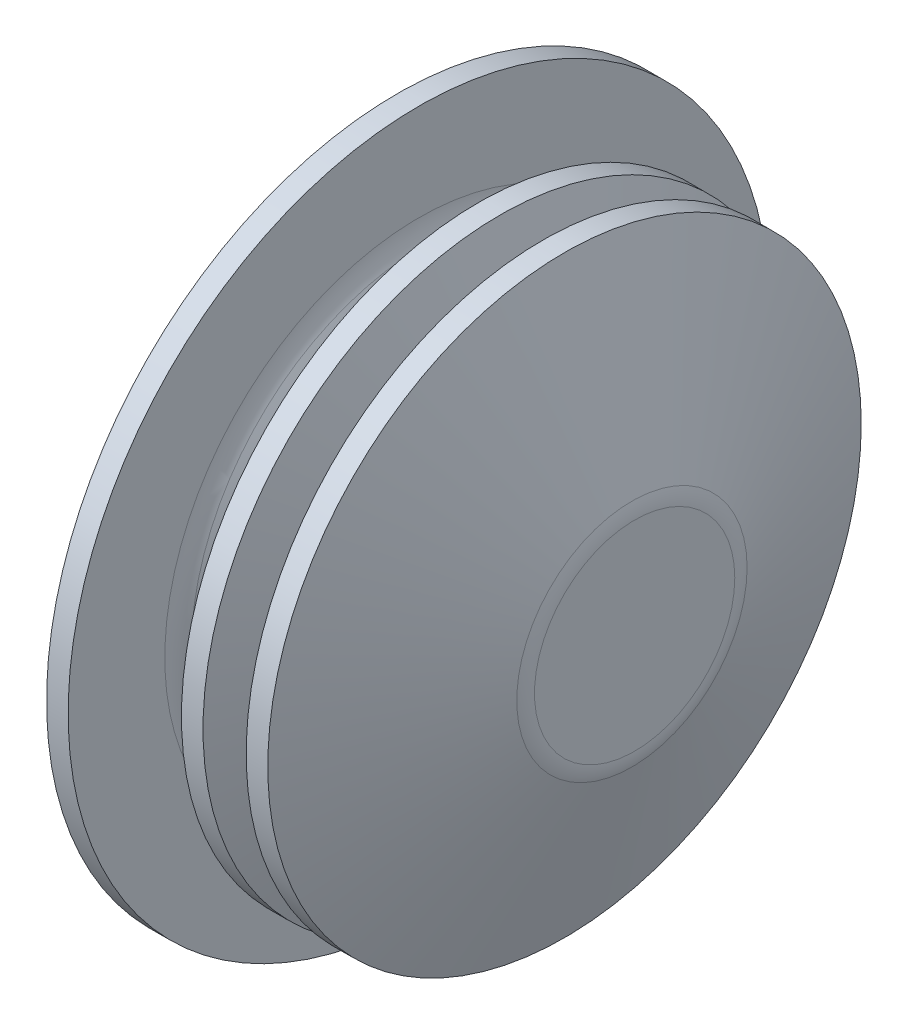
ISO-10303-21;
HEADER;
FILE_DESCRIPTION(('STEP AP214'),'2;1');
FILE_NAME('part.step','',(''),(''),'','','');
FILE_SCHEMA(('AUTOMOTIVE_DESIGN { 1 0 10303 214 1 1 1 1 }'));
ENDSEC;
DATA;
#1=APPLICATION_CONTEXT('core data for automotive mechanical design processes');
#2=APPLICATION_PROTOCOL_DEFINITION('international standard','automotive_design',2000,#1);
#3=PRODUCT_CONTEXT('',#1,'mechanical');
#4=PRODUCT('Part','Part','',(#3));
#5=PRODUCT_RELATED_PRODUCT_CATEGORY('part','',(#4));
#6=PRODUCT_DEFINITION_FORMATION('','',#4);
#7=PRODUCT_DEFINITION_CONTEXT('part definition',#1,'design');
#8=PRODUCT_DEFINITION('design','',#6,#7);
#9=PRODUCT_DEFINITION_SHAPE('','',#8);
#10=(LENGTH_UNIT() NAMED_UNIT(*) SI_UNIT(.MILLI.,.METRE.));
#11=(NAMED_UNIT(*) PLANE_ANGLE_UNIT() SI_UNIT($,.RADIAN.));
#12=(NAMED_UNIT(*) SI_UNIT($,.STERADIAN.) SOLID_ANGLE_UNIT());
#13=UNCERTAINTY_MEASURE_WITH_UNIT(LENGTH_MEASURE(1.E-05),#10,'distance_accuracy_value','');
#14=(GEOMETRIC_REPRESENTATION_CONTEXT(3) GLOBAL_UNCERTAINTY_ASSIGNED_CONTEXT((#13)) GLOBAL_UNIT_ASSIGNED_CONTEXT((#10,
#11,#12)) REPRESENTATION_CONTEXT('',''));
#15=CARTESIAN_POINT('',(0.,0.,0.));
#16=DIRECTION('',(0.,0.,1.));
#17=DIRECTION('',(1.,0.,0.));
#18=AXIS2_PLACEMENT_3D('',#15,#16,#17);
#19=CARTESIAN_POINT('',(0.,0.,0.));
#20=DIRECTION('',(-1.,0.,0.));
#21=DIRECTION('',(0.,0.,1.));
#22=AXIS2_PLACEMENT_3D('',#19,#20,#21);
#23=PLANE('',#22);
#24=CARTESIAN_POINT('',(0.,0.,0.));
#25=DIRECTION('',(1.,0.,0.));
#26=DIRECTION('',(0.,0.,-1.));
#27=AXIS2_PLACEMENT_3D('',#24,#25,#26);
#28=CIRCLE('',#27,13.);
#29=CARTESIAN_POINT('',(0.,0.,-13.));
#30=VERTEX_POINT('',#29);
#31=EDGE_CURVE('E10',#30,#30,#28,.T.);
#32=ORIENTED_EDGE('',*,*,#31,.F.);
#33=EDGE_LOOP('',(#32));
#34=FACE_BOUND('',#33,.T.);
#35=ADVANCED_FACE('F31',(#34),#23,.T.);
#36=CARTESIAN_POINT('',(8.80000000000001,0.,0.));
#37=DIRECTION('',(1.,0.,0.));
#38=DIRECTION('',(0.,0.,-1.));
#39=AXIS2_PLACEMENT_3D('',#36,#37,#38);
#40=CYLINDRICAL_SURFACE('',#39,13.);
#41=ORIENTED_EDGE('',*,*,#31,.T.);
#42=EDGE_LOOP('',(#41));
#43=FACE_BOUND('',#42,.T.);
#44=CARTESIAN_POINT('',(0.799999999999999,0.,0.));
#45=DIRECTION('',(1.,0.,0.));
#46=DIRECTION('',(0.,0.,-1.));
#47=AXIS2_PLACEMENT_3D('',#44,#45,#46);
#48=CIRCLE('',#47,13.);
#49=CARTESIAN_POINT('',(0.8,0.,-13.));
#50=VERTEX_POINT('',#49);
#51=EDGE_CURVE('E37',#50,#50,#48,.T.);
#52=ORIENTED_EDGE('',*,*,#51,.F.);
#53=EDGE_LOOP('',(#52));
#54=FACE_BOUND('',#53,.T.);
#55=ADVANCED_FACE('F109',(#43,#54),#40,.T.);
#56=CARTESIAN_POINT('',(0.800000000000001,0.,-13.));
#57=DIRECTION('',(1.,0.,0.));
#58=DIRECTION('',(0.,0.,-1.));
#59=AXIS2_PLACEMENT_3D('',#56,#57,#58);
#60=PLANE('',#59);
#61=ORIENTED_EDGE('',*,*,#51,.T.);
#62=EDGE_LOOP('',(#61));
#63=FACE_BOUND('',#62,.T.);
#64=CARTESIAN_POINT('',(0.799999999999999,0.,0.));
#65=DIRECTION('',(1.,0.,0.));
#66=DIRECTION('',(0.,0.,-1.));
#67=AXIS2_PLACEMENT_3D('',#64,#65,#66);
#68=CIRCLE('',#67,9.41749686443301);
#69=CARTESIAN_POINT('',(0.8,0.,-9.41749686443301));
#70=VERTEX_POINT('',#69);
#71=EDGE_CURVE('E41',#70,#70,#68,.T.);
#72=ORIENTED_EDGE('',*,*,#71,.F.);
#73=EDGE_LOOP('',(#72));
#74=FACE_BOUND('',#73,.T.);
#75=ADVANCED_FACE('F114',(#63,#74),#60,.T.);
#76=CARTESIAN_POINT('',(2.4,0.,0.));
#77=DIRECTION('',(1.,0.,0.));
#78=DIRECTION('',(0.,0.,-1.));
#79=AXIS2_PLACEMENT_3D('',#76,#77,#78);
#80=TOROIDAL_SURFACE('',#79,9.41749686443301,1.6);
#81=ORIENTED_EDGE('',*,*,#71,.T.);
#82=EDGE_LOOP('',(#81));
#83=FACE_BOUND('',#82,.T.);
#84=CARTESIAN_POINT('',(1.00399037448045,0.,0.));
#85=DIRECTION('',(1.,0.,0.));
#86=DIRECTION('',(0.,0.,-1.));
#87=AXIS2_PLACEMENT_3D('',#84,#85,#86);
#88=CIRCLE('',#87,8.63573147414206);
#89=CARTESIAN_POINT('',(1.00399037448045,0.,-8.63573147414206));
#90=VERTEX_POINT('',#89);
#91=EDGE_CURVE('E45',#90,#90,#88,.T.);
#92=ORIENTED_EDGE('',*,*,#91,.F.);
#93=EDGE_LOOP('',(#92));
#94=FACE_BOUND('',#93,.T.);
#95=ADVANCED_FACE('F118',(#83,#94),#80,.F.);
#96=CARTESIAN_POINT('',(3.14178861856293,0.,0.));
#97=DIRECTION('',(-1.,0.,0.));
#98=DIRECTION('',(0.,0.,1.));
#99=AXIS2_PLACEMENT_3D('',#96,#97,#98);
#100=CONICAL_SURFACE('',#99,4.81823460970905,1.06030800487812);
#101=ORIENTED_EDGE('',*,*,#91,.T.);
#102=EDGE_LOOP('',(#101));
#103=FACE_BOUND('',#102,.T.);
#104=CARTESIAN_POINT('',(3.14178861856293,0.,0.));
#105=DIRECTION('',(1.,0.,0.));
#106=DIRECTION('',(0.,0.,-1.));
#107=AXIS2_PLACEMENT_3D('',#104,#105,#106);
#108=CIRCLE('',#107,4.81823460970905);
#109=CARTESIAN_POINT('',(3.14178861856293,0.,-4.81823460970905));
#110=VERTEX_POINT('',#109);
#111=EDGE_CURVE('E50',#110,#110,#108,.T.);
#112=ORIENTED_EDGE('',*,*,#111,.F.);
#113=EDGE_LOOP('',(#112));
#114=FACE_BOUND('',#113,.T.);
#115=ADVANCED_FACE('F124',(#103,#114),#100,.T.);
#116=CARTESIAN_POINT('',(4.53779824408248,0.,0.));
#117=DIRECTION('',(1.,0.,0.));
#118=DIRECTION('',(0.,0.,-1.));
#119=AXIS2_PLACEMENT_3D('',#116,#117,#118);
#120=TOROIDAL_SURFACE('',#119,5.6,1.6);
#121=ORIENTED_EDGE('',*,*,#111,.T.);
#122=EDGE_LOOP('',(#121));
#123=FACE_BOUND('',#122,.T.);
#124=CARTESIAN_POINT('',(4.53779824408248,0.,0.));
#125=DIRECTION('',(1.,0.,0.));
#126=DIRECTION('',(0.,0.,-1.));
#127=AXIS2_PLACEMENT_3D('',#124,#125,#126);
#128=CIRCLE('',#127,4.);
#129=CARTESIAN_POINT('',(4.53779824408248,0.,-4.));
#130=VERTEX_POINT('',#129);
#131=EDGE_CURVE('E53',#130,#130,#128,.T.);
#132=ORIENTED_EDGE('',*,*,#131,.F.);
#133=EDGE_LOOP('',(#132));
#134=FACE_BOUND('',#133,.T.);
#135=ADVANCED_FACE('F128',(#123,#134),#120,.F.);
#136=CARTESIAN_POINT('',(8.80000000000001,0.,0.));
#137=DIRECTION('',(1.,0.,0.));
#138=DIRECTION('',(0.,0.,-1.));
#139=AXIS2_PLACEMENT_3D('',#136,#137,#138);
#140=CYLINDRICAL_SURFACE('',#139,4.);
#141=ORIENTED_EDGE('',*,*,#131,.T.);
#142=EDGE_LOOP('',(#141));
#143=FACE_BOUND('',#142,.T.);
#144=CARTESIAN_POINT('',(5.16854591938409,0.,0.));
#145=DIRECTION('',(1.,0.,0.));
#146=DIRECTION('',(0.,0.,-1.));
#147=AXIS2_PLACEMENT_3D('',#144,#145,#146);
#148=CIRCLE('',#147,4.);
#149=CARTESIAN_POINT('',(5.16854591938409,0.,-4.));
#150=VERTEX_POINT('',#149);
#151=EDGE_CURVE('E56',#150,#150,#148,.T.);
#152=ORIENTED_EDGE('',*,*,#151,.F.);
#153=EDGE_LOOP('',(#152));
#154=FACE_BOUND('',#153,.T.);
#155=ADVANCED_FACE('F132',(#143,#154),#140,.T.);
#156=CARTESIAN_POINT('',(5.1685459193841,0.,0.));
#157=DIRECTION('',(1.,0.,0.));
#158=DIRECTION('',(0.,0.,-1.));
#159=AXIS2_PLACEMENT_3D('',#156,#157,#158);
#160=TOROIDAL_SURFACE('',#159,4.3,0.3);
#161=ORIENTED_EDGE('',*,*,#151,.T.);
#162=EDGE_LOOP('',(#161));
#163=FACE_BOUND('',#162,.T.);
#164=CARTESIAN_POINT('',(5.44977350098702,0.,0.));
#165=DIRECTION('',(1.,0.,0.));
#166=DIRECTION('',(0.,0.,-1.));
#167=AXIS2_PLACEMENT_3D('',#164,#165,#166);
#168=CIRCLE('',#167,4.40445595888109);
#169=CARTESIAN_POINT('',(5.44977350098702,0.,-4.40445595888109));
#170=VERTEX_POINT('',#169);
#171=EDGE_CURVE('E59',#170,#170,#168,.T.);
#172=ORIENTED_EDGE('',*,*,#171,.F.);
#173=EDGE_LOOP('',(#172));
#174=FACE_BOUND('',#173,.T.);
#175=ADVANCED_FACE('F136',(#163,#174),#160,.F.);
#176=CARTESIAN_POINT('',(3.,0.,0.));
#177=DIRECTION('',(-1.,0.,0.));
#178=DIRECTION('',(0.,0.,1.));
#179=AXIS2_PLACEMENT_3D('',#176,#177,#178);
#180=CONICAL_SURFACE('',#179,11.,1.21516044249414);
#181=ORIENTED_EDGE('',*,*,#171,.T.);
#182=EDGE_LOOP('',(#181));
#183=FACE_BOUND('',#182,.T.);
#184=CARTESIAN_POINT('',(3.,0.,0.));
#185=DIRECTION('',(1.,0.,0.));
#186=DIRECTION('',(0.,0.,-1.));
#187=AXIS2_PLACEMENT_3D('',#184,#185,#186);
#188=CIRCLE('',#187,11.);
#189=CARTESIAN_POINT('',(3.,0.,-11.));
#190=VERTEX_POINT('',#189);
#191=EDGE_CURVE('E62',#190,#190,#188,.T.);
#192=ORIENTED_EDGE('',*,*,#191,.F.);
#193=EDGE_LOOP('',(#192));
#194=FACE_BOUND('',#193,.T.);
#195=ADVANCED_FACE('F140',(#183,#194),#180,.F.);
#196=CARTESIAN_POINT('',(8.80000000000001,0.,0.));
#197=DIRECTION('',(1.,0.,0.));
#198=DIRECTION('',(0.,0.,-1.));
#199=AXIS2_PLACEMENT_3D('',#196,#197,#198);
#200=CYLINDRICAL_SURFACE('',#199,11.);
#201=ORIENTED_EDGE('',*,*,#191,.T.);
#202=EDGE_LOOP('',(#201));
#203=FACE_BOUND('',#202,.T.);
#204=CARTESIAN_POINT('',(3.8,0.,0.));
#205=DIRECTION('',(1.,0.,0.));
#206=DIRECTION('',(0.,0.,-1.));
#207=AXIS2_PLACEMENT_3D('',#204,#205,#206);
#208=CIRCLE('',#207,11.);
#209=CARTESIAN_POINT('',(3.8,0.,-11.));
#210=VERTEX_POINT('',#209);
#211=EDGE_CURVE('E65',#210,#210,#208,.T.);
#212=ORIENTED_EDGE('',*,*,#211,.F.);
#213=EDGE_LOOP('',(#212));
#214=FACE_BOUND('',#213,.T.);
#215=ADVANCED_FACE('F144',(#203,#214),#200,.T.);
#216=CARTESIAN_POINT('',(6.01263656616444,0.,0.));
#217=DIRECTION('',(-1.,0.,0.));
#218=DIRECTION('',(0.,0.,1.));
#219=AXIS2_PLACEMENT_3D('',#216,#217,#218);
#220=CONICAL_SURFACE('',#219,5.0429015526342,1.21516044249414);
#221=ORIENTED_EDGE('',*,*,#211,.T.);
#222=EDGE_LOOP('',(#221));
#223=FACE_BOUND('',#222,.T.);
#224=CARTESIAN_POINT('',(6.01263656616444,0.,0.));
#225=DIRECTION('',(1.,0.,0.));
#226=DIRECTION('',(0.,0.,-1.));
#227=AXIS2_PLACEMENT_3D('',#224,#225,#226);
#228=CIRCLE('',#227,5.0429015526342);
#229=CARTESIAN_POINT('',(6.01263656616444,0.,-5.0429015526342));
#230=VERTEX_POINT('',#229);
#231=EDGE_CURVE('E68',#230,#230,#228,.T.);
#232=ORIENTED_EDGE('',*,*,#231,.F.);
#233=EDGE_LOOP('',(#232));
#234=FACE_BOUND('',#233,.T.);
#235=ADVANCED_FACE('F148',(#223,#234),#220,.T.);
#236=CARTESIAN_POINT('',(7.51251700138007,0.,0.));
#237=DIRECTION('',(1.,0.,0.));
#238=DIRECTION('',(0.,0.,-1.));
#239=AXIS2_PLACEMENT_3D('',#236,#237,#238);
#240=TOROIDAL_SURFACE('',#239,5.6,1.6);
#241=ORIENTED_EDGE('',*,*,#231,.T.);
#242=EDGE_LOOP('',(#241));
#243=FACE_BOUND('',#242,.T.);
#244=CARTESIAN_POINT('',(7.51251700138007,0.,0.));
#245=DIRECTION('',(1.,0.,0.));
#246=DIRECTION('',(0.,0.,-1.));
#247=AXIS2_PLACEMENT_3D('',#244,#245,#246);
#248=CIRCLE('',#247,4.);
#249=CARTESIAN_POINT('',(7.51251700138007,0.,-4.));
#250=VERTEX_POINT('',#249);
#251=EDGE_CURVE('E71',#250,#250,#248,.T.);
#252=ORIENTED_EDGE('',*,*,#251,.F.);
#253=EDGE_LOOP('',(#252));
#254=FACE_BOUND('',#253,.T.);
#255=ADVANCED_FACE('F152',(#243,#254),#240,.F.);
#256=CARTESIAN_POINT('',(8.80000000000001,0.,0.));
#257=DIRECTION('',(1.,0.,0.));
#258=DIRECTION('',(0.,0.,-1.));
#259=AXIS2_PLACEMENT_3D('',#256,#257,#258);
#260=CYLINDRICAL_SURFACE('',#259,4.);
#261=ORIENTED_EDGE('',*,*,#251,.T.);
#262=EDGE_LOOP('',(#261));
#263=FACE_BOUND('',#262,.T.);
#264=CARTESIAN_POINT('',(7.56854591938409,0.,0.));
#265=DIRECTION('',(1.,0.,0.));
#266=DIRECTION('',(0.,0.,-1.));
#267=AXIS2_PLACEMENT_3D('',#264,#265,#266);
#268=CIRCLE('',#267,4.);
#269=CARTESIAN_POINT('',(7.56854591938409,0.,-4.));
#270=VERTEX_POINT('',#269);
#271=EDGE_CURVE('E74',#270,#270,#268,.T.);
#272=ORIENTED_EDGE('',*,*,#271,.F.);
#273=EDGE_LOOP('',(#272));
#274=FACE_BOUND('',#273,.T.);
#275=ADVANCED_FACE('F156',(#263,#274),#260,.T.);
#276=CARTESIAN_POINT('',(7.5685459193841,0.,0.));
#277=DIRECTION('',(1.,0.,0.));
#278=DIRECTION('',(0.,0.,-1.));
#279=AXIS2_PLACEMENT_3D('',#276,#277,#278);
#280=TOROIDAL_SURFACE('',#279,4.3,0.3);
#281=ORIENTED_EDGE('',*,*,#271,.T.);
#282=EDGE_LOOP('',(#281));
#283=FACE_BOUND('',#282,.T.);
#284=CARTESIAN_POINT('',(7.84977350098703,0.,0.));
#285=DIRECTION('',(1.,0.,0.));
#286=DIRECTION('',(0.,0.,-1.));
#287=AXIS2_PLACEMENT_3D('',#284,#285,#286);
#288=CIRCLE('',#287,4.40445595888109);
#289=CARTESIAN_POINT('',(7.84977350098703,0.,-4.40445595888109));
#290=VERTEX_POINT('',#289);
#291=EDGE_CURVE('E77',#290,#290,#288,.T.);
#292=ORIENTED_EDGE('',*,*,#291,.F.);
#293=EDGE_LOOP('',(#292));
#294=FACE_BOUND('',#293,.T.);
#295=ADVANCED_FACE('F160',(#283,#294),#280,.F.);
#296=CARTESIAN_POINT('',(5.4,0.,0.));
#297=DIRECTION('',(-1.,0.,0.));
#298=DIRECTION('',(0.,0.,1.));
#299=AXIS2_PLACEMENT_3D('',#296,#297,#298);
#300=CONICAL_SURFACE('',#299,11.,1.21516044249414);
#301=ORIENTED_EDGE('',*,*,#291,.T.);
#302=EDGE_LOOP('',(#301));
#303=FACE_BOUND('',#302,.T.);
#304=CARTESIAN_POINT('',(5.4,0.,0.));
#305=DIRECTION('',(1.,0.,0.));
#306=DIRECTION('',(0.,0.,-1.));
#307=AXIS2_PLACEMENT_3D('',#304,#305,#306);
#308=CIRCLE('',#307,11.);
#309=CARTESIAN_POINT('',(5.4,0.,-11.));
#310=VERTEX_POINT('',#309);
#311=EDGE_CURVE('E80',#310,#310,#308,.T.);
#312=ORIENTED_EDGE('',*,*,#311,.F.);
#313=EDGE_LOOP('',(#312));
#314=FACE_BOUND('',#313,.T.);
#315=ADVANCED_FACE('F164',(#303,#314),#300,.F.);
#316=CARTESIAN_POINT('',(8.80000000000001,0.,0.));
#317=DIRECTION('',(1.,0.,0.));
#318=DIRECTION('',(0.,0.,-1.));
#319=AXIS2_PLACEMENT_3D('',#316,#317,#318);
#320=CYLINDRICAL_SURFACE('',#319,11.);
#321=ORIENTED_EDGE('',*,*,#311,.T.);
#322=EDGE_LOOP('',(#321));
#323=FACE_BOUND('',#322,.T.);
#324=CARTESIAN_POINT('',(6.2,0.,0.));
#325=DIRECTION('',(1.,0.,0.));
#326=DIRECTION('',(0.,0.,-1.));
#327=AXIS2_PLACEMENT_3D('',#324,#325,#326);
#328=CIRCLE('',#327,11.);
#329=CARTESIAN_POINT('',(6.2,0.,-11.));
#330=VERTEX_POINT('',#329);
#331=EDGE_CURVE('E83',#330,#330,#328,.T.);
#332=ORIENTED_EDGE('',*,*,#331,.F.);
#333=EDGE_LOOP('',(#332));
#334=FACE_BOUND('',#333,.T.);
#335=ADVANCED_FACE('F105',(#323,#334),#320,.T.);
#336=CARTESIAN_POINT('',(8.69988043521563,0.,0.));
#337=DIRECTION('',(-1.,0.,0.));
#338=DIRECTION('',(0.,0.,1.));
#339=AXIS2_PLACEMENT_3D('',#336,#337,#338);
#340=CONICAL_SURFACE('',#339,4.26955267441947,1.21516044249414);
#341=ORIENTED_EDGE('',*,*,#331,.T.);
#342=EDGE_LOOP('',(#341));
#343=FACE_BOUND('',#342,.T.);
#344=CARTESIAN_POINT('',(8.69988043521563,0.,0.));
#345=DIRECTION('',(1.,0.,0.));
#346=DIRECTION('',(0.,0.,-1.));
#347=AXIS2_PLACEMENT_3D('',#344,#345,#346);
#348=CIRCLE('',#347,4.26955267441947);
#349=CARTESIAN_POINT('',(8.69988043521563,0.,-4.26955267441947));
#350=VERTEX_POINT('',#349);
#351=EDGE_CURVE('E86',#350,#350,#348,.T.);
#352=ORIENTED_EDGE('',*,*,#351,.F.);
#353=EDGE_LOOP('',(#352));
#354=FACE_BOUND('',#353,.T.);
#355=ADVANCED_FACE('F97',(#343,#354),#340,.T.);
#356=CARTESIAN_POINT('',(7.2,0.,0.));
#357=DIRECTION('',(1.,0.,0.));
#358=DIRECTION('',(0.,0.,-1.));
#359=AXIS2_PLACEMENT_3D('',#356,#357,#358);
#360=TOROIDAL_SURFACE('',#359,3.71245422705367,1.6);
#361=ORIENTED_EDGE('',*,*,#351,.T.);
#362=EDGE_LOOP('',(#361));
#363=FACE_BOUND('',#362,.T.);
#364=CARTESIAN_POINT('',(8.8,0.,0.));
#365=DIRECTION('',(1.,0.,0.));
#366=DIRECTION('',(0.,0.,-1.));
#367=AXIS2_PLACEMENT_3D('',#364,#365,#366);
#368=CIRCLE('',#367,3.71245422705367);
#369=CARTESIAN_POINT('',(8.8,0.,-3.71245422705366));
#370=VERTEX_POINT('',#369);
#371=EDGE_CURVE('E89',#370,#370,#368,.T.);
#372=ORIENTED_EDGE('',*,*,#371,.F.);
#373=EDGE_LOOP('',(#372));
#374=FACE_BOUND('',#373,.T.);
#375=ADVANCED_FACE('F95',(#363,#374),#360,.T.);
#376=CARTESIAN_POINT('',(8.8,0.,-3.71245422705366));
#377=DIRECTION('',(1.,0.,0.));
#378=DIRECTION('',(0.,0.,-1.));
#379=AXIS2_PLACEMENT_3D('',#376,#377,#378);
#380=PLANE('',#379);
#381=ORIENTED_EDGE('',*,*,#371,.T.);
#382=EDGE_LOOP('',(#381));
#383=FACE_BOUND('',#382,.T.);
#384=ADVANCED_FACE('F93',(#383),#380,.T.);
#385=CLOSED_SHELL('',(#35,#55,#75,#95,#115,#135,#155,#175,#195,#215,#235,#255,#275,#295,#315,
#335,#355,#375,#384));
#386=MANIFOLD_SOLID_BREP('B2',#385);
#387=ADVANCED_BREP_SHAPE_REPRESENTATION('',(#18,#386),#14);
#388=SHAPE_DEFINITION_REPRESENTATION(#9,#387);
ENDSEC;
END-ISO-10303-21;
